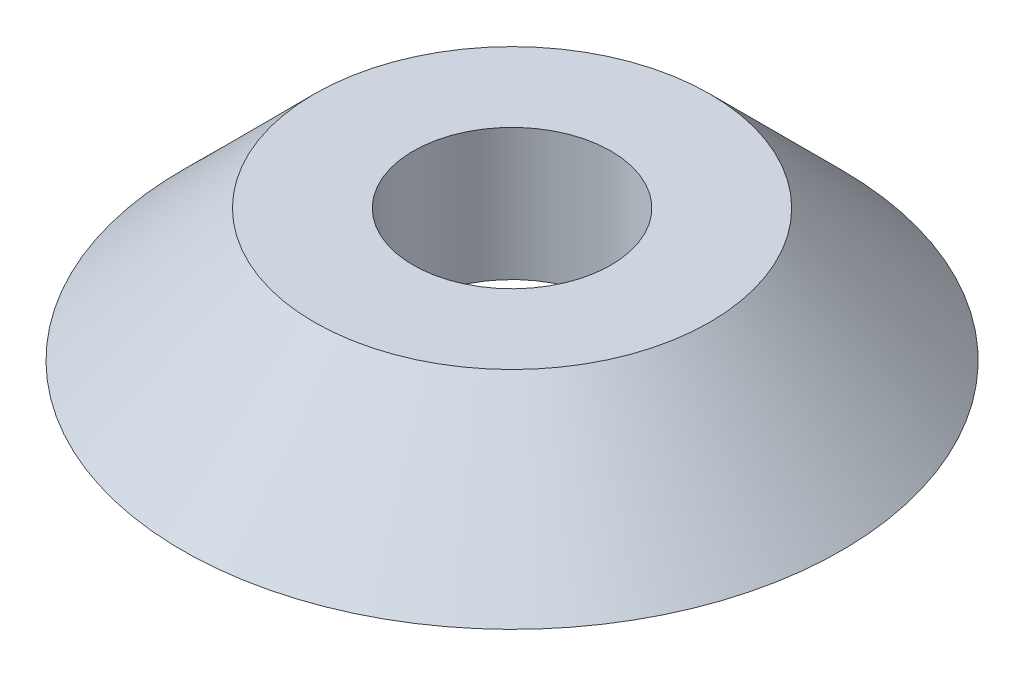
ISO-10303-21;
HEADER;
FILE_DESCRIPTION(('STEP AP214'),'2;1');
FILE_NAME('part.step','',(''),(''),'','','');
FILE_SCHEMA(('AUTOMOTIVE_DESIGN { 1 0 10303 214 1 1 1 1 }'));
ENDSEC;
DATA;
#1=APPLICATION_CONTEXT('core data for automotive mechanical design processes');
#2=APPLICATION_PROTOCOL_DEFINITION('international standard','automotive_design',2000,#1);
#3=PRODUCT_CONTEXT('',#1,'mechanical');
#4=PRODUCT('Part','Part','',(#3));
#5=PRODUCT_RELATED_PRODUCT_CATEGORY('part','',(#4));
#6=PRODUCT_DEFINITION_FORMATION('','',#4);
#7=PRODUCT_DEFINITION_CONTEXT('part definition',#1,'design');
#8=PRODUCT_DEFINITION('design','',#6,#7);
#9=PRODUCT_DEFINITION_SHAPE('','',#8);
#10=(LENGTH_UNIT() NAMED_UNIT(*) SI_UNIT(.MILLI.,.METRE.));
#11=(NAMED_UNIT(*) PLANE_ANGLE_UNIT() SI_UNIT($,.RADIAN.));
#12=(NAMED_UNIT(*) SI_UNIT($,.STERADIAN.) SOLID_ANGLE_UNIT());
#13=UNCERTAINTY_MEASURE_WITH_UNIT(LENGTH_MEASURE(1.E-05),#10,'distance_accuracy_value','');
#14=(GEOMETRIC_REPRESENTATION_CONTEXT(3) GLOBAL_UNCERTAINTY_ASSIGNED_CONTEXT((#13)) GLOBAL_UNIT_ASSIGNED_CONTEXT((#10,
#11,#12)) REPRESENTATION_CONTEXT('',''));
#15=CARTESIAN_POINT('',(0.,0.,0.));
#16=DIRECTION('',(0.,0.,1.));
#17=DIRECTION('',(1.,0.,0.));
#18=AXIS2_PLACEMENT_3D('',#15,#16,#17);
#19=CARTESIAN_POINT('',(0.,0.,0.));
#20=DIRECTION('',(0.,-1.,0.));
#21=DIRECTION('',(0.,0.,-1.));
#22=AXIS2_PLACEMENT_3D('',#19,#20,#21);
#23=CONICAL_SURFACE('',#22,31.7500000000001,0.785398163397454);
#24=CARTESIAN_POINT('',(0.,12.6999999999999,0.));
#25=DIRECTION('',(0.,-1.,0.));
#26=DIRECTION('',(0.,0.,-1.));
#27=AXIS2_PLACEMENT_3D('',#24,#25,#26);
#28=CIRCLE('',#27,19.05);
#29=CARTESIAN_POINT('',(0.,12.6999999999999,-19.05));
#30=VERTEX_POINT('',#29);
#31=EDGE_CURVE('E10',#30,#30,#28,.T.);
#32=ORIENTED_EDGE('',*,*,#31,.T.);
#33=EDGE_LOOP('',(#32));
#34=FACE_BOUND('',#33,.T.);
#35=CARTESIAN_POINT('',(0.,0.,0.));
#36=DIRECTION('',(0.,-1.,0.));
#37=DIRECTION('',(0.,0.,-1.));
#38=AXIS2_PLACEMENT_3D('',#35,#36,#37);
#39=CIRCLE('',#38,31.7500000000001);
#40=CARTESIAN_POINT('',(0.,0.,-31.7500000000001));
#41=VERTEX_POINT('',#40);
#42=EDGE_CURVE('E44',#41,#41,#39,.T.);
#43=ORIENTED_EDGE('',*,*,#42,.F.);
#44=EDGE_LOOP('',(#43));
#45=FACE_BOUND('',#44,.T.);
#46=ADVANCED_FACE('F30',(#34,#45),#23,.T.);
#47=CARTESIAN_POINT('',(19.05,12.7,0.));
#48=DIRECTION('',(0.,1.,0.));
#49=DIRECTION('',(0.,0.,1.));
#50=AXIS2_PLACEMENT_3D('',#47,#48,#49);
#51=PLANE('',#50);
#52=CARTESIAN_POINT('',(0.,12.6999999999999,0.));
#53=DIRECTION('',(0.,-1.,0.));
#54=DIRECTION('',(0.,0.,-1.));
#55=AXIS2_PLACEMENT_3D('',#52,#53,#54);
#56=CIRCLE('',#55,9.525);
#57=CARTESIAN_POINT('',(0.,12.6999999999999,-9.525));
#58=VERTEX_POINT('',#57);
#59=EDGE_CURVE('E36',#58,#58,#56,.T.);
#60=ORIENTED_EDGE('',*,*,#59,.T.);
#61=EDGE_LOOP('',(#60));
#62=FACE_BOUND('',#61,.T.);
#63=ORIENTED_EDGE('',*,*,#31,.F.);
#64=EDGE_LOOP('',(#63));
#65=FACE_BOUND('',#64,.T.);
#66=ADVANCED_FACE('F54',(#62,#65),#51,.T.);
#67=CARTESIAN_POINT('',(0.,-1000.69375591004,0.));
#68=DIRECTION('',(0.,-1.,0.));
#69=DIRECTION('',(0.,0.,-1.));
#70=AXIS2_PLACEMENT_3D('',#67,#68,#69);
#71=CYLINDRICAL_SURFACE('',#70,9.525);
#72=CARTESIAN_POINT('',(0.,0.,0.));
#73=DIRECTION('',(0.,-1.,0.));
#74=DIRECTION('',(0.,0.,-1.));
#75=AXIS2_PLACEMENT_3D('',#72,#73,#74);
#76=CIRCLE('',#75,9.525);
#77=CARTESIAN_POINT('',(0.,0.,-9.525));
#78=VERTEX_POINT('',#77);
#79=EDGE_CURVE('E40',#78,#78,#76,.T.);
#80=ORIENTED_EDGE('',*,*,#79,.T.);
#81=EDGE_LOOP('',(#80));
#82=FACE_BOUND('',#81,.T.);
#83=ORIENTED_EDGE('',*,*,#59,.F.);
#84=EDGE_LOOP('',(#83));
#85=FACE_BOUND('',#84,.T.);
#86=ADVANCED_FACE('F58',(#82,#85),#71,.F.);
#87=CARTESIAN_POINT('',(9.525,0.,0.));
#88=DIRECTION('',(0.,-1.,0.));
#89=DIRECTION('',(0.,0.,-1.));
#90=AXIS2_PLACEMENT_3D('',#87,#88,#89);
#91=PLANE('',#90);
#92=ORIENTED_EDGE('',*,*,#42,.T.);
#93=EDGE_LOOP('',(#92));
#94=FACE_BOUND('',#93,.T.);
#95=ORIENTED_EDGE('',*,*,#79,.F.);
#96=EDGE_LOOP('',(#95));
#97=FACE_BOUND('',#96,.T.);
#98=ADVANCED_FACE('F50',(#94,#97),#91,.T.);
#99=CLOSED_SHELL('',(#46,#66,#86,#98));
#100=MANIFOLD_SOLID_BREP('B2',#99);
#101=ADVANCED_BREP_SHAPE_REPRESENTATION('',(#18,#100),#14);
#102=SHAPE_DEFINITION_REPRESENTATION(#9,#101);
ENDSEC;
END-ISO-10303-21;
